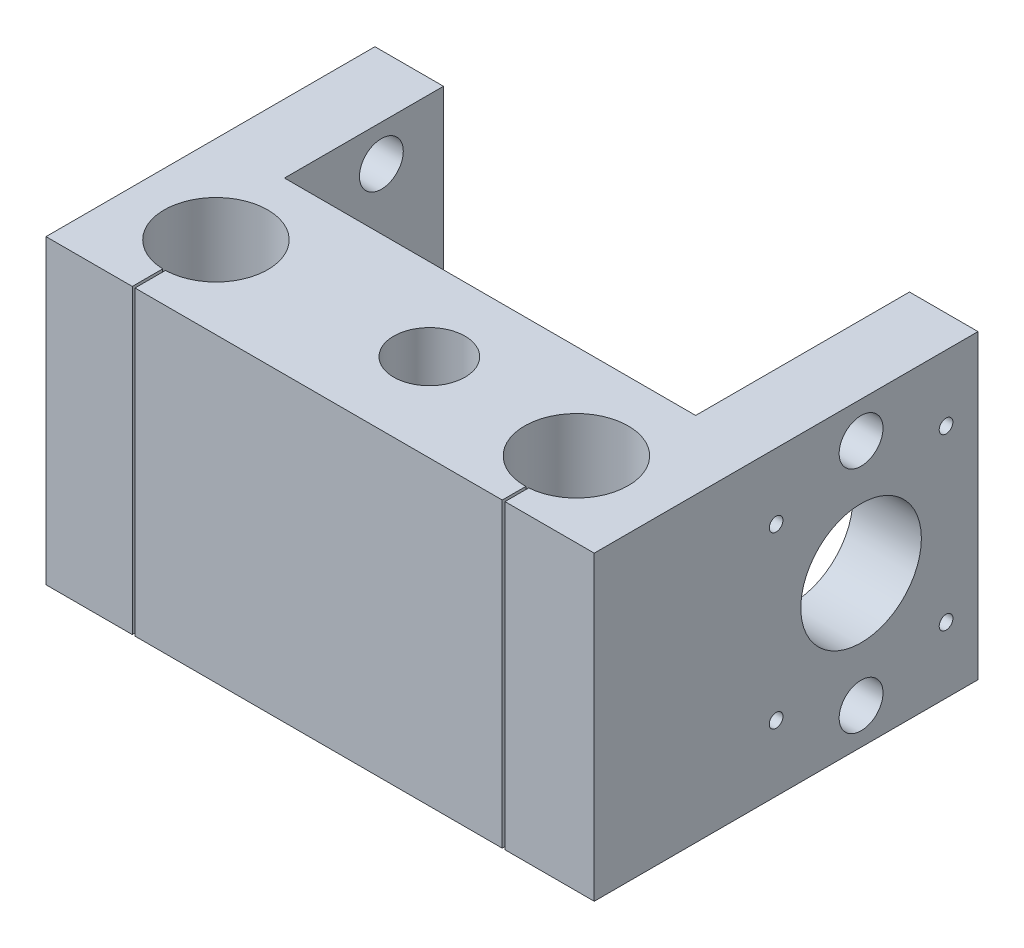
ISO-10303-21;
HEADER;
FILE_DESCRIPTION(('STEP AP214'),'2;1');
FILE_NAME('part.step','',(''),(''),'','','');
FILE_SCHEMA(('AUTOMOTIVE_DESIGN { 1 0 10303 214 1 1 1 1 }'));
ENDSEC;
DATA;
#1=APPLICATION_CONTEXT('core data for automotive mechanical design processes');
#2=APPLICATION_PROTOCOL_DEFINITION('international standard','automotive_design',2000,#1);
#3=PRODUCT_CONTEXT('',#1,'mechanical');
#4=PRODUCT('Part','Part','',(#3));
#5=PRODUCT_RELATED_PRODUCT_CATEGORY('part','',(#4));
#6=PRODUCT_DEFINITION_FORMATION('','',#4);
#7=PRODUCT_DEFINITION_CONTEXT('part definition',#1,'design');
#8=PRODUCT_DEFINITION('design','',#6,#7);
#9=PRODUCT_DEFINITION_SHAPE('','',#8);
#10=(LENGTH_UNIT() NAMED_UNIT(*) SI_UNIT(.MILLI.,.METRE.));
#11=(NAMED_UNIT(*) PLANE_ANGLE_UNIT() SI_UNIT($,.RADIAN.));
#12=(NAMED_UNIT(*) SI_UNIT($,.STERADIAN.) SOLID_ANGLE_UNIT());
#13=UNCERTAINTY_MEASURE_WITH_UNIT(LENGTH_MEASURE(1.E-05),#10,'distance_accuracy_value','');
#14=(GEOMETRIC_REPRESENTATION_CONTEXT(3) GLOBAL_UNCERTAINTY_ASSIGNED_CONTEXT((#13)) GLOBAL_UNIT_ASSIGNED_CONTEXT((#10,
#11,#12)) REPRESENTATION_CONTEXT('',''));
#15=CARTESIAN_POINT('',(0.,0.,0.));
#16=DIRECTION('',(0.,0.,1.));
#17=DIRECTION('',(1.,0.,0.));
#18=AXIS2_PLACEMENT_3D('',#15,#16,#17);
#19=CARTESIAN_POINT('',(0.,55.,35.));
#20=DIRECTION('',(0.,0.,-1.));
#21=DIRECTION('',(-1.,0.,0.));
#22=AXIS2_PLACEMENT_3D('',#19,#20,#21);
#23=PLANE('',#22);
#24=DIRECTION('',(0.,-1.,0.));
#25=VECTOR('',#24,1.);
#26=CARTESIAN_POINT('',(-34.2640564316728,55.,35.));
#27=LINE('',#26,#25);
#28=CARTESIAN_POINT('',(-34.2640564316728,55.,35.));
#29=VERTEX_POINT('',#28);
#30=CARTESIAN_POINT('',(-34.2640564316728,0.,35.));
#31=VERTEX_POINT('',#30);
#32=EDGE_CURVE('E153',#29,#31,#27,.T.);
#33=ORIENTED_EDGE('',*,*,#32,.F.);
#34=DIRECTION('',(1.,0.,0.));
#35=VECTOR('',#34,1.);
#36=CARTESIAN_POINT('',(0.,55.,35.));
#37=LINE('',#36,#35);
#38=CARTESIAN_POINT('',(-50.,55.,35.));
#39=VERTEX_POINT('',#38);
#40=EDGE_CURVE('E228',#39,#29,#37,.T.);
#41=ORIENTED_EDGE('',*,*,#40,.F.);
#42=DIRECTION('',(0.,-1.,0.));
#43=VECTOR('',#42,1.);
#44=CARTESIAN_POINT('',(-50.,55.,35.));
#45=LINE('',#44,#43);
#46=CARTESIAN_POINT('',(-50.,0.,35.));
#47=VERTEX_POINT('',#46);
#48=EDGE_CURVE('E183',#39,#47,#45,.T.);
#49=ORIENTED_EDGE('',*,*,#48,.T.);
#50=DIRECTION('',(1.,0.,0.));
#51=VECTOR('',#50,1.);
#52=CARTESIAN_POINT('',(0.,0.,35.));
#53=LINE('',#52,#51);
#54=EDGE_CURVE('E173',#47,#31,#53,.T.);
#55=ORIENTED_EDGE('',*,*,#54,.T.);
#56=EDGE_LOOP('',(#33,#41,#49,#55));
#57=FACE_BOUND('',#56,.T.);
#58=ADVANCED_FACE('F41',(#57),#23,.F.);
#59=CARTESIAN_POINT('',(-33.7640564316728,55.,35.));
#60=VERTEX_POINT('',#59);
#61=CARTESIAN_POINT('',(33.2214587828726,55.,35.));
#62=VERTEX_POINT('',#61);
#63=EDGE_CURVE('E231',#60,#62,#37,.T.);
#64=ORIENTED_EDGE('',*,*,#63,.F.);
#65=DIRECTION('',(0.,-1.,0.));
#66=VECTOR('',#65,1.);
#67=CARTESIAN_POINT('',(-33.7640564316728,55.,35.));
#68=LINE('',#67,#66);
#69=CARTESIAN_POINT('',(-33.7640564316728,0.,35.));
#70=VERTEX_POINT('',#69);
#71=EDGE_CURVE('E165',#60,#70,#68,.T.);
#72=ORIENTED_EDGE('',*,*,#71,.T.);
#73=CARTESIAN_POINT('',(33.2214587828726,0.,35.));
#74=VERTEX_POINT('',#73);
#75=EDGE_CURVE('E186',#70,#74,#53,.T.);
#76=ORIENTED_EDGE('',*,*,#75,.T.);
#77=DIRECTION('',(0.,-1.,0.));
#78=VECTOR('',#77,1.);
#79=CARTESIAN_POINT('',(33.2214587828726,55.,35.));
#80=LINE('',#79,#78);
#81=EDGE_CURVE('E348',#62,#74,#80,.T.);
#82=ORIENTED_EDGE('',*,*,#81,.F.);
#83=EDGE_LOOP('',(#64,#72,#76,#82));
#84=FACE_BOUND('',#83,.T.);
#85=ADVANCED_FACE('F401',(#84),#23,.F.);
#86=CARTESIAN_POINT('',(0.,55.,-35.));
#87=DIRECTION('',(0.,0.,-1.));
#88=DIRECTION('',(-1.,0.,0.));
#89=AXIS2_PLACEMENT_3D('',#86,#87,#88);
#90=PLANE('',#89);
#91=DIRECTION('',(1.,0.,0.));
#92=VECTOR('',#91,1.);
#93=CARTESIAN_POINT('',(0.,0.,-35.));
#94=LINE('',#93,#92);
#95=CARTESIAN_POINT('',(37.5,0.,-35.));
#96=VERTEX_POINT('',#95);
#97=CARTESIAN_POINT('',(50.,0.,-35.));
#98=VERTEX_POINT('',#97);
#99=EDGE_CURVE('E218',#96,#98,#94,.T.);
#100=ORIENTED_EDGE('',*,*,#99,.F.);
#101=DIRECTION('',(0.,-1.,0.));
#102=VECTOR('',#101,1.);
#103=CARTESIAN_POINT('',(37.5,55.,-35.));
#104=LINE('',#103,#102);
#105=CARTESIAN_POINT('',(37.5,55.,-35.));
#106=VERTEX_POINT('',#105);
#107=EDGE_CURVE('E419',#106,#96,#104,.T.);
#108=ORIENTED_EDGE('',*,*,#107,.F.);
#109=DIRECTION('',(1.,0.,0.));
#110=VECTOR('',#109,1.);
#111=CARTESIAN_POINT('',(0.,55.,-35.));
#112=LINE('',#111,#110);
#113=CARTESIAN_POINT('',(50.,55.,-35.));
#114=VERTEX_POINT('',#113);
#115=EDGE_CURVE('E192',#106,#114,#112,.T.);
#116=ORIENTED_EDGE('',*,*,#115,.T.);
#117=DIRECTION('',(0.,-1.,0.));
#118=VECTOR('',#117,1.);
#119=CARTESIAN_POINT('',(50.,55.,-35.));
#120=LINE('',#119,#118);
#121=EDGE_CURVE('E227',#114,#98,#120,.T.);
#122=ORIENTED_EDGE('',*,*,#121,.T.);
#123=EDGE_LOOP('',(#100,#108,#116,#122));
#124=FACE_BOUND('',#123,.T.);
#125=ADVANCED_FACE('F418',(#124),#90,.T.);
#126=CARTESIAN_POINT('',(37.5,55.,0.));
#127=DIRECTION('',(1.,0.,0.));
#128=DIRECTION('',(0.,0.,-1.));
#129=AXIS2_PLACEMENT_3D('',#126,#127,#128);
#130=PLANE('',#129);
#131=CARTESIAN_POINT('',(37.5,48.4000000000001,-13.6731293068473));
#132=DIRECTION('',(1.,0.,0.));
#133=DIRECTION('',(0.,0.,-1.));
#134=AXIS2_PLACEMENT_3D('',#131,#132,#133);
#135=CIRCLE('',#134,4.);
#136=CARTESIAN_POINT('',(37.5,48.4000000000001,-17.6731293068473));
#137=VERTEX_POINT('',#136);
#138=EDGE_CURVE('E314',#137,#137,#135,.T.);
#139=ORIENTED_EDGE('',*,*,#138,.T.);
#140=EDGE_LOOP('',(#139));
#141=FACE_BOUND('',#140,.T.);
#142=CARTESIAN_POINT('',(37.5,6.60000000000007,-13.6731293068473));
#143=DIRECTION('',(1.,0.,0.));
#144=DIRECTION('',(0.,0.,-1.));
#145=AXIS2_PLACEMENT_3D('',#142,#143,#144);
#146=CIRCLE('',#145,4.);
#147=CARTESIAN_POINT('',(37.5,6.60000000000007,-17.6731293068473));
#148=VERTEX_POINT('',#147);
#149=EDGE_CURVE('E323',#148,#148,#146,.T.);
#150=ORIENTED_EDGE('',*,*,#149,.T.);
#151=EDGE_LOOP('',(#150));
#152=FACE_BOUND('',#151,.T.);
#153=CARTESIAN_POINT('',(37.5,27.5000000000001,-13.6731293068474));
#154=DIRECTION('',(1.,0.,0.));
#155=DIRECTION('',(0.,0.,-1.));
#156=AXIS2_PLACEMENT_3D('',#153,#154,#155);
#157=CIRCLE('',#156,11.);
#158=CARTESIAN_POINT('',(37.5,27.5000000000001,-24.6731293068474));
#159=VERTEX_POINT('',#158);
#160=EDGE_CURVE('E300',#159,#159,#157,.T.);
#161=ORIENTED_EDGE('',*,*,#160,.T.);
#162=EDGE_LOOP('',(#161));
#163=FACE_BOUND('',#162,.T.);
#164=CARTESIAN_POINT('',(37.5,43.,-29.1731293068474));
#165=DIRECTION('',(1.,0.,0.));
#166=DIRECTION('',(0.,0.,-1.));
#167=AXIS2_PLACEMENT_3D('',#164,#165,#166);
#168=CIRCLE('',#167,1.25);
#169=CARTESIAN_POINT('',(37.5,43.,-30.4231293068474));
#170=VERTEX_POINT('',#169);
#171=EDGE_CURVE('E272',#170,#170,#168,.T.);
#172=ORIENTED_EDGE('',*,*,#171,.T.);
#173=EDGE_LOOP('',(#172));
#174=FACE_BOUND('',#173,.T.);
#175=CARTESIAN_POINT('',(37.5,43.,1.82687069315264));
#176=DIRECTION('',(1.,0.,0.));
#177=DIRECTION('',(0.,0.,-1.));
#178=AXIS2_PLACEMENT_3D('',#175,#176,#177);
#179=CIRCLE('',#178,1.25);
#180=CARTESIAN_POINT('',(37.5,43.,0.576870693152641));
#181=VERTEX_POINT('',#180);
#182=EDGE_CURVE('E278',#181,#181,#179,.T.);
#183=ORIENTED_EDGE('',*,*,#182,.T.);
#184=EDGE_LOOP('',(#183));
#185=FACE_BOUND('',#184,.T.);
#186=CARTESIAN_POINT('',(37.5,12.,1.82687069315263));
#187=DIRECTION('',(1.,0.,0.));
#188=DIRECTION('',(0.,0.,-1.));
#189=AXIS2_PLACEMENT_3D('',#186,#187,#188);
#190=CIRCLE('',#189,1.25000000000001);
#191=CARTESIAN_POINT('',(37.5,12.,0.576870693152622));
#192=VERTEX_POINT('',#191);
#193=EDGE_CURVE('E282',#192,#192,#190,.T.);
#194=ORIENTED_EDGE('',*,*,#193,.T.);
#195=EDGE_LOOP('',(#194));
#196=FACE_BOUND('',#195,.T.);
#197=CARTESIAN_POINT('',(37.5,12.0000000000001,-29.1731293068474));
#198=DIRECTION('',(1.,0.,0.));
#199=DIRECTION('',(0.,0.,-1.));
#200=AXIS2_PLACEMENT_3D('',#197,#198,#199);
#201=CIRCLE('',#200,1.25);
#202=CARTESIAN_POINT('',(37.5,12.0000000000001,-30.4231293068474));
#203=VERTEX_POINT('',#202);
#204=EDGE_CURVE('E286',#203,#203,#201,.T.);
#205=ORIENTED_EDGE('',*,*,#204,.T.);
#206=EDGE_LOOP('',(#205));
#207=FACE_BOUND('',#206,.T.);
#208=DIRECTION('',(0.,0.,1.));
#209=VECTOR('',#208,1.);
#210=CARTESIAN_POINT('',(37.5,0.,0.));
#211=LINE('',#210,#209);
#212=CARTESIAN_POINT('',(37.5,0.,4.));
#213=VERTEX_POINT('',#212);
#214=EDGE_CURVE('E214',#96,#213,#211,.T.);
#215=ORIENTED_EDGE('',*,*,#214,.T.);
#216=DIRECTION('',(0.,-1.,0.));
#217=VECTOR('',#216,1.);
#218=CARTESIAN_POINT('',(37.5,55.,4.));
#219=LINE('',#218,#217);
#220=CARTESIAN_POINT('',(37.5,55.,4.));
#221=VERTEX_POINT('',#220);
#222=EDGE_CURVE('E425',#221,#213,#219,.T.);
#223=ORIENTED_EDGE('',*,*,#222,.F.);
#224=DIRECTION('',(0.,0.,1.));
#225=VECTOR('',#224,1.);
#226=CARTESIAN_POINT('',(37.5,55.,0.));
#227=LINE('',#226,#225);
#228=EDGE_CURVE('E243',#106,#221,#227,.T.);
#229=ORIENTED_EDGE('',*,*,#228,.F.);
#230=ORIENTED_EDGE('',*,*,#107,.T.);
#231=EDGE_LOOP('',(#215,#223,#229,#230));
#232=FACE_BOUND('',#231,.T.);
#233=ADVANCED_FACE('F43',(#141,#152,#163,#174,#185,#196,#207,#232),#130,.F.);
#234=CARTESIAN_POINT('',(0.,55.,4.));
#235=DIRECTION('',(0.,0.,-1.));
#236=DIRECTION('',(-1.,0.,0.));
#237=AXIS2_PLACEMENT_3D('',#234,#235,#236);
#238=PLANE('',#237);
#239=DIRECTION('',(1.,0.,0.));
#240=VECTOR('',#239,1.);
#241=CARTESIAN_POINT('',(0.,0.,4.));
#242=LINE('',#241,#240);
#243=CARTESIAN_POINT('',(-37.5,0.,4.));
#244=VERTEX_POINT('',#243);
#245=EDGE_CURVE('E208',#244,#213,#242,.T.);
#246=ORIENTED_EDGE('',*,*,#245,.F.);
#247=DIRECTION('',(0.,-1.,0.));
#248=VECTOR('',#247,1.);
#249=CARTESIAN_POINT('',(-37.5,55.,4.));
#250=LINE('',#249,#248);
#251=CARTESIAN_POINT('',(-37.5,55.,4.));
#252=VERTEX_POINT('',#251);
#253=EDGE_CURVE('E430',#252,#244,#250,.T.);
#254=ORIENTED_EDGE('',*,*,#253,.F.);
#255=DIRECTION('',(1.,0.,0.));
#256=VECTOR('',#255,1.);
#257=CARTESIAN_POINT('',(0.,55.,4.));
#258=LINE('',#257,#256);
#259=EDGE_CURVE('E239',#252,#221,#258,.T.);
#260=ORIENTED_EDGE('',*,*,#259,.T.);
#261=ORIENTED_EDGE('',*,*,#222,.T.);
#262=EDGE_LOOP('',(#246,#254,#260,#261));
#263=FACE_BOUND('',#262,.T.);
#264=ADVANCED_FACE('F433',(#263),#238,.T.);
#265=CARTESIAN_POINT('',(-37.5,55.,0.));
#266=DIRECTION('',(1.,0.,0.));
#267=DIRECTION('',(0.,0.,-1.));
#268=AXIS2_PLACEMENT_3D('',#265,#266,#267);
#269=PLANE('',#268);
#270=CARTESIAN_POINT('',(-37.5,27.5000000000001,-13.6731293068473));
#271=DIRECTION('',(1.,0.,0.));
#272=DIRECTION('',(0.,0.,-1.));
#273=AXIS2_PLACEMENT_3D('',#270,#271,#272);
#274=CIRCLE('',#273,4.);
#275=CARTESIAN_POINT('',(-37.5,27.5000000000001,-17.6731293068473));
#276=VERTEX_POINT('',#275);
#277=EDGE_CURVE('E341',#276,#276,#274,.T.);
#278=ORIENTED_EDGE('',*,*,#277,.F.);
#279=EDGE_LOOP('',(#278));
#280=FACE_BOUND('',#279,.T.);
#281=CARTESIAN_POINT('',(-37.5,48.4000000000001,-13.6731293068473));
#282=DIRECTION('',(1.,0.,0.));
#283=DIRECTION('',(0.,0.,-1.));
#284=AXIS2_PLACEMENT_3D('',#281,#282,#283);
#285=CIRCLE('',#284,4.);
#286=CARTESIAN_POINT('',(-37.5,48.4000000000001,-17.6731293068473));
#287=VERTEX_POINT('',#286);
#288=EDGE_CURVE('E318',#287,#287,#285,.T.);
#289=ORIENTED_EDGE('',*,*,#288,.F.);
#290=EDGE_LOOP('',(#289));
#291=FACE_BOUND('',#290,.T.);
#292=CARTESIAN_POINT('',(-37.5,6.60000000000007,-13.6731293068473));
#293=DIRECTION('',(1.,0.,0.));
#294=DIRECTION('',(0.,0.,-1.));
#295=AXIS2_PLACEMENT_3D('',#292,#293,#294);
#296=CIRCLE('',#295,4.);
#297=CARTESIAN_POINT('',(-37.5,6.60000000000007,-17.6731293068473));
#298=VERTEX_POINT('',#297);
#299=EDGE_CURVE('E327',#298,#298,#296,.T.);
#300=ORIENTED_EDGE('',*,*,#299,.F.);
#301=EDGE_LOOP('',(#300));
#302=FACE_BOUND('',#301,.T.);
#303=DIRECTION('',(0.,-1.,0.));
#304=VECTOR('',#303,1.);
#305=CARTESIAN_POINT('',(-37.5,0.,-25.));
#306=LINE('',#305,#304);
#307=CARTESIAN_POINT('',(-37.5,55.,-25.));
#308=VERTEX_POINT('',#307);
#309=CARTESIAN_POINT('',(-37.5,0.,-25.));
#310=VERTEX_POINT('',#309);
#311=EDGE_CURVE('E257',#308,#310,#306,.T.);
#312=ORIENTED_EDGE('',*,*,#311,.F.);
#313=DIRECTION('',(0.,0.,1.));
#314=VECTOR('',#313,1.);
#315=CARTESIAN_POINT('',(-37.5,55.,0.));
#316=LINE('',#315,#314);
#317=EDGE_CURVE('E236',#308,#252,#316,.T.);
#318=ORIENTED_EDGE('',*,*,#317,.T.);
#319=ORIENTED_EDGE('',*,*,#253,.T.);
#320=DIRECTION('',(0.,0.,1.));
#321=VECTOR('',#320,1.);
#322=CARTESIAN_POINT('',(-37.5,0.,0.));
#323=LINE('',#322,#321);
#324=EDGE_CURVE('E204',#310,#244,#323,.T.);
#325=ORIENTED_EDGE('',*,*,#324,.F.);
#326=EDGE_LOOP('',(#312,#318,#319,#325));
#327=FACE_BOUND('',#326,.T.);
#328=ADVANCED_FACE('F466',(#280,#291,#302,#327),#269,.T.);
#329=CARTESIAN_POINT('',(-50.,55.,0.));
#330=DIRECTION('',(1.,0.,0.));
#331=DIRECTION('',(0.,0.,-1.));
#332=AXIS2_PLACEMENT_3D('',#329,#330,#331);
#333=PLANE('',#332);
#334=CARTESIAN_POINT('',(-50.,27.5000000000001,-13.6731293068473));
#335=DIRECTION('',(1.,0.,0.));
#336=DIRECTION('',(0.,0.,-1.));
#337=AXIS2_PLACEMENT_3D('',#334,#335,#336);
#338=CIRCLE('',#337,4.);
#339=CARTESIAN_POINT('',(-50.,27.5000000000001,-17.6731293068473));
#340=VERTEX_POINT('',#339);
#341=EDGE_CURVE('E337',#340,#340,#338,.T.);
#342=ORIENTED_EDGE('',*,*,#341,.T.);
#343=EDGE_LOOP('',(#342));
#344=FACE_BOUND('',#343,.T.);
#345=CARTESIAN_POINT('',(-50.,48.4000000000001,-13.6731293068473));
#346=DIRECTION('',(1.,0.,0.));
#347=DIRECTION('',(0.,0.,-1.));
#348=AXIS2_PLACEMENT_3D('',#345,#346,#347);
#349=CIRCLE('',#348,4.);
#350=CARTESIAN_POINT('',(-50.,48.4000000000001,-17.6731293068473));
#351=VERTEX_POINT('',#350);
#352=EDGE_CURVE('E336',#351,#351,#349,.T.);
#353=ORIENTED_EDGE('',*,*,#352,.T.);
#354=EDGE_LOOP('',(#353));
#355=FACE_BOUND('',#354,.T.);
#356=CARTESIAN_POINT('',(-50.,6.60000000000007,-13.6731293068473));
#357=DIRECTION('',(1.,0.,0.));
#358=DIRECTION('',(0.,0.,-1.));
#359=AXIS2_PLACEMENT_3D('',#356,#357,#358);
#360=CIRCLE('',#359,4.);
#361=CARTESIAN_POINT('',(-50.,6.60000000000007,-17.6731293068473));
#362=VERTEX_POINT('',#361);
#363=EDGE_CURVE('E332',#362,#362,#360,.T.);
#364=ORIENTED_EDGE('',*,*,#363,.T.);
#365=EDGE_LOOP('',(#364));
#366=FACE_BOUND('',#365,.T.);
#367=DIRECTION('',(0.,0.,1.));
#368=VECTOR('',#367,1.);
#369=CARTESIAN_POINT('',(-50.,55.,0.));
#370=LINE('',#369,#368);
#371=CARTESIAN_POINT('',(-50.,55.,-25.));
#372=VERTEX_POINT('',#371);
#373=EDGE_CURVE('E233',#372,#39,#370,.T.);
#374=ORIENTED_EDGE('',*,*,#373,.F.);
#375=DIRECTION('',(0.,1.,0.));
#376=VECTOR('',#375,1.);
#377=CARTESIAN_POINT('',(-50.,0.,-25.));
#378=LINE('',#377,#376);
#379=CARTESIAN_POINT('',(-50.,0.,-25.));
#380=VERTEX_POINT('',#379);
#381=EDGE_CURVE('E251',#380,#372,#378,.T.);
#382=ORIENTED_EDGE('',*,*,#381,.F.);
#383=DIRECTION('',(0.,0.,1.));
#384=VECTOR('',#383,1.);
#385=CARTESIAN_POINT('',(-50.,0.,0.));
#386=LINE('',#385,#384);
#387=EDGE_CURVE('E197',#380,#47,#386,.T.);
#388=ORIENTED_EDGE('',*,*,#387,.T.);
#389=ORIENTED_EDGE('',*,*,#48,.F.);
#390=EDGE_LOOP('',(#374,#382,#388,#389));
#391=FACE_BOUND('',#390,.T.);
#392=ADVANCED_FACE('F470',(#344,#355,#366,#391),#333,.F.);
#393=CARTESIAN_POINT('',(33.7214587828726,55.,35.));
#394=VERTEX_POINT('',#393);
#395=CARTESIAN_POINT('',(50.,55.,35.));
#396=VERTEX_POINT('',#395);
#397=EDGE_CURVE('E232',#394,#396,#37,.T.);
#398=ORIENTED_EDGE('',*,*,#397,.F.);
#399=DIRECTION('',(0.,-1.,0.));
#400=VECTOR('',#399,1.);
#401=CARTESIAN_POINT('',(33.7214587828726,55.,35.));
#402=LINE('',#401,#400);
#403=CARTESIAN_POINT('',(33.7214587828726,0.,35.));
#404=VERTEX_POINT('',#403);
#405=EDGE_CURVE('E345',#394,#404,#402,.T.);
#406=ORIENTED_EDGE('',*,*,#405,.T.);
#407=CARTESIAN_POINT('',(50.,0.,35.));
#408=VERTEX_POINT('',#407);
#409=EDGE_CURVE('E188',#404,#408,#53,.T.);
#410=ORIENTED_EDGE('',*,*,#409,.T.);
#411=DIRECTION('',(0.,-1.,0.));
#412=VECTOR('',#411,1.);
#413=CARTESIAN_POINT('',(50.,55.,35.));
#414=LINE('',#413,#412);
#415=EDGE_CURVE('E408',#396,#408,#414,.T.);
#416=ORIENTED_EDGE('',*,*,#415,.F.);
#417=EDGE_LOOP('',(#398,#406,#410,#416));
#418=FACE_BOUND('',#417,.T.);
#419=ADVANCED_FACE('F409',(#418),#23,.F.);
#420=CARTESIAN_POINT('',(50.,55.,0.));
#421=DIRECTION('',(1.,0.,0.));
#422=DIRECTION('',(0.,0.,-1.));
#423=AXIS2_PLACEMENT_3D('',#420,#421,#422);
#424=PLANE('',#423);
#425=CARTESIAN_POINT('',(50.,48.4000000000001,-13.6731293068473));
#426=DIRECTION('',(1.,0.,0.));
#427=DIRECTION('',(0.,0.,-1.));
#428=AXIS2_PLACEMENT_3D('',#425,#426,#427);
#429=CIRCLE('',#428,4.);
#430=CARTESIAN_POINT('',(50.,48.4000000000001,-17.6731293068473));
#431=VERTEX_POINT('',#430);
#432=EDGE_CURVE('E322',#431,#431,#429,.T.);
#433=ORIENTED_EDGE('',*,*,#432,.F.);
#434=EDGE_LOOP('',(#433));
#435=FACE_BOUND('',#434,.T.);
#436=CARTESIAN_POINT('',(50.,6.60000000000007,-13.6731293068473));
#437=DIRECTION('',(1.,0.,0.));
#438=DIRECTION('',(0.,0.,-1.));
#439=AXIS2_PLACEMENT_3D('',#436,#437,#438);
#440=CIRCLE('',#439,4.);
#441=CARTESIAN_POINT('',(50.,6.60000000000007,-17.6731293068473));
#442=VERTEX_POINT('',#441);
#443=EDGE_CURVE('E331',#442,#442,#440,.T.);
#444=ORIENTED_EDGE('',*,*,#443,.F.);
#445=EDGE_LOOP('',(#444));
#446=FACE_BOUND('',#445,.T.);
#447=CARTESIAN_POINT('',(50.,27.5000000000001,-13.6731293068474));
#448=DIRECTION('',(1.,0.,0.));
#449=DIRECTION('',(0.,0.,-1.));
#450=AXIS2_PLACEMENT_3D('',#447,#448,#449);
#451=CIRCLE('',#450,11.);
#452=CARTESIAN_POINT('',(50.,27.5000000000001,-24.6731293068474));
#453=VERTEX_POINT('',#452);
#454=EDGE_CURVE('E310',#453,#453,#451,.T.);
#455=ORIENTED_EDGE('',*,*,#454,.F.);
#456=EDGE_LOOP('',(#455));
#457=FACE_BOUND('',#456,.T.);
#458=CARTESIAN_POINT('',(50.,43.,-29.1731293068474));
#459=DIRECTION('',(1.,0.,0.));
#460=DIRECTION('',(0.,0.,-1.));
#461=AXIS2_PLACEMENT_3D('',#458,#459,#460);
#462=CIRCLE('',#461,1.25);
#463=CARTESIAN_POINT('',(50.,43.,-30.4231293068474));
#464=VERTEX_POINT('',#463);
#465=EDGE_CURVE('E295',#464,#464,#462,.T.);
#466=ORIENTED_EDGE('',*,*,#465,.F.);
#467=EDGE_LOOP('',(#466));
#468=FACE_BOUND('',#467,.T.);
#469=CARTESIAN_POINT('',(50.,43.,1.82687069315264));
#470=DIRECTION('',(1.,0.,0.));
#471=DIRECTION('',(0.,0.,-1.));
#472=AXIS2_PLACEMENT_3D('',#469,#470,#471);
#473=CIRCLE('',#472,1.25);
#474=CARTESIAN_POINT('',(50.,43.,0.576870693152637));
#475=VERTEX_POINT('',#474);
#476=EDGE_CURVE('E299',#475,#475,#473,.T.);
#477=ORIENTED_EDGE('',*,*,#476,.F.);
#478=EDGE_LOOP('',(#477));
#479=FACE_BOUND('',#478,.T.);
#480=CARTESIAN_POINT('',(50.,12.,1.82687069315262));
#481=DIRECTION('',(1.,0.,0.));
#482=DIRECTION('',(0.,0.,-1.));
#483=AXIS2_PLACEMENT_3D('',#480,#481,#482);
#484=CIRCLE('',#483,1.25000000000001);
#485=CARTESIAN_POINT('',(50.,12.,0.576870693152618));
#486=VERTEX_POINT('',#485);
#487=EDGE_CURVE('E294',#486,#486,#484,.T.);
#488=ORIENTED_EDGE('',*,*,#487,.F.);
#489=EDGE_LOOP('',(#488));
#490=FACE_BOUND('',#489,.T.);
#491=CARTESIAN_POINT('',(50.,12.0000000000001,-29.1731293068474));
#492=DIRECTION('',(1.,0.,0.));
#493=DIRECTION('',(0.,0.,-1.));
#494=AXIS2_PLACEMENT_3D('',#491,#492,#493);
#495=CIRCLE('',#494,1.25);
#496=CARTESIAN_POINT('',(50.,12.0000000000001,-30.4231293068474));
#497=VERTEX_POINT('',#496);
#498=EDGE_CURVE('E290',#497,#497,#495,.T.);
#499=ORIENTED_EDGE('',*,*,#498,.F.);
#500=EDGE_LOOP('',(#499));
#501=FACE_BOUND('',#500,.T.);
#502=DIRECTION('',(0.,0.,1.));
#503=VECTOR('',#502,1.);
#504=CARTESIAN_POINT('',(50.,0.,0.));
#505=LINE('',#504,#503);
#506=EDGE_CURVE('E185',#98,#408,#505,.T.);
#507=ORIENTED_EDGE('',*,*,#506,.F.);
#508=ORIENTED_EDGE('',*,*,#121,.F.);
#509=DIRECTION('',(0.,0.,1.));
#510=VECTOR('',#509,1.);
#511=CARTESIAN_POINT('',(50.,55.,0.));
#512=LINE('',#511,#510);
#513=EDGE_CURVE('E223',#114,#396,#512,.T.);
#514=ORIENTED_EDGE('',*,*,#513,.T.);
#515=ORIENTED_EDGE('',*,*,#415,.T.);
#516=EDGE_LOOP('',(#507,#508,#514,#515));
#517=FACE_BOUND('',#516,.T.);
#518=ADVANCED_FACE('F391',(#435,#446,#457,#468,#479,#490,#501,#517),#424,.T.);
#519=CARTESIAN_POINT('',(0.,55.,0.));
#520=DIRECTION('',(0.,1.,0.));
#521=DIRECTION('',(0.,0.,1.));
#522=AXIS2_PLACEMENT_3D('',#519,#520,#521);
#523=PLANE('',#522);
#524=CARTESIAN_POINT('',(3.92538324830508,55.,19.));
#525=DIRECTION('',(0.,1.,0.));
#526=DIRECTION('',(0.,0.,1.));
#527=AXIS2_PLACEMENT_3D('',#524,#525,#526);
#528=CIRCLE('',#527,6.5);
#529=CARTESIAN_POINT('',(3.92538324830508,55.,25.5));
#530=VERTEX_POINT('',#529);
#531=EDGE_CURVE('E372',#530,#530,#528,.T.);
#532=ORIENTED_EDGE('',*,*,#531,.F.);
#533=EDGE_LOOP('',(#532));
#534=FACE_BOUND('',#533,.T.);
#535=DIRECTION('',(0.,0.,1.));
#536=VECTOR('',#535,1.);
#537=CARTESIAN_POINT('',(-33.7640564316728,55.,27.0280887580647));
#538=LINE('',#537,#536);
#539=CARTESIAN_POINT('',(-33.7640564316728,55.,29.4470540716439));
#540=VERTEX_POINT('',#539);
#541=EDGE_CURVE('E178',#540,#60,#538,.T.);
#542=ORIENTED_EDGE('',*,*,#541,.T.);
#543=ORIENTED_EDGE('',*,*,#63,.T.);
#544=DIRECTION('',(0.,0.,1.));
#545=VECTOR('',#544,1.);
#546=CARTESIAN_POINT('',(33.2214587828726,55.,28.5713865865584));
#547=LINE('',#546,#545);
#548=CARTESIAN_POINT('',(33.2214587828726,55.,30.6974047233877));
#549=VERTEX_POINT('',#548);
#550=EDGE_CURVE('E356',#549,#62,#547,.T.);
#551=ORIENTED_EDGE('',*,*,#550,.F.);
#552=CARTESIAN_POINT('',(33.,55.,21.25));
#553=DIRECTION('',(0.,1.,0.));
#554=DIRECTION('',(0.,0.,1.));
#555=AXIS2_PLACEMENT_3D('',#552,#553,#554);
#556=CIRCLE('',#555,9.45);
#557=CARTESIAN_POINT('',(33.7214587828726,55.,30.6724199240225));
#558=VERTEX_POINT('',#557);
#559=EDGE_CURVE('E261',#558,#549,#556,.T.);
#560=ORIENTED_EDGE('',*,*,#559,.F.);
#561=DIRECTION('',(0.,0.,1.));
#562=VECTOR('',#561,1.);
#563=CARTESIAN_POINT('',(33.7214587828726,55.,28.5713865865584));
#564=LINE('',#563,#562);
#565=EDGE_CURVE('E57',#558,#394,#564,.T.);
#566=ORIENTED_EDGE('',*,*,#565,.T.);
#567=ORIENTED_EDGE('',*,*,#397,.T.);
#568=ORIENTED_EDGE('',*,*,#513,.F.);
#569=ORIENTED_EDGE('',*,*,#115,.F.);
#570=ORIENTED_EDGE('',*,*,#228,.T.);
#571=ORIENTED_EDGE('',*,*,#259,.F.);
#572=ORIENTED_EDGE('',*,*,#317,.F.);
#573=DIRECTION('',(1.,0.,0.));
#574=VECTOR('',#573,1.);
#575=CARTESIAN_POINT('',(-37.5,55.,-25.));
#576=LINE('',#575,#574);
#577=EDGE_CURVE('E222',#372,#308,#576,.T.);
#578=ORIENTED_EDGE('',*,*,#577,.F.);
#579=ORIENTED_EDGE('',*,*,#373,.T.);
#580=ORIENTED_EDGE('',*,*,#40,.T.);
#581=DIRECTION('',(0.,0.,1.));
#582=VECTOR('',#581,1.);
#583=CARTESIAN_POINT('',(-34.2640564316728,55.,27.0280887580647));
#584=LINE('',#583,#582);
#585=CARTESIAN_POINT('',(-34.2640564316728,55.,29.4463100838841));
#586=VERTEX_POINT('',#585);
#587=EDGE_CURVE('E159',#586,#29,#584,.T.);
#588=ORIENTED_EDGE('',*,*,#587,.F.);
#589=CARTESIAN_POINT('',(-34.0000000000004,55.,19.9999999999999));
#590=DIRECTION('',(0.,1.,0.));
#591=DIRECTION('',(0.,0.,1.));
#592=AXIS2_PLACEMENT_3D('',#589,#590,#591);
#593=CIRCLE('',#592,9.45);
#594=EDGE_CURVE('E268',#540,#586,#593,.T.);
#595=ORIENTED_EDGE('',*,*,#594,.F.);
#596=EDGE_LOOP('',(#542,#543,#551,#560,#566,#567,#568,#569,#570,#571,#572,#578,#579,#580,#588,#595));
#597=FACE_BOUND('',#596,.T.);
#598=ADVANCED_FACE('F388',(#534,#597),#523,.T.);
#599=CARTESIAN_POINT('',(0.,0.,0.));
#600=DIRECTION('',(0.,1.,0.));
#601=DIRECTION('',(0.,0.,1.));
#602=AXIS2_PLACEMENT_3D('',#599,#600,#601);
#603=PLANE('',#602);
#604=CARTESIAN_POINT('',(3.92538324830508,0.,19.));
#605=DIRECTION('',(0.,1.,0.));
#606=DIRECTION('',(0.,0.,1.));
#607=AXIS2_PLACEMENT_3D('',#604,#605,#606);
#608=CIRCLE('',#607,6.5);
#609=CARTESIAN_POINT('',(3.92538324830508,0.,25.5));
#610=VERTEX_POINT('',#609);
#611=EDGE_CURVE('E359',#610,#610,#608,.T.);
#612=ORIENTED_EDGE('',*,*,#611,.T.);
#613=EDGE_LOOP('',(#612));
#614=FACE_BOUND('',#613,.T.);
#615=ORIENTED_EDGE('',*,*,#75,.F.);
#616=DIRECTION('',(0.,0.,1.));
#617=VECTOR('',#616,1.);
#618=CARTESIAN_POINT('',(-33.7640564316728,0.,27.0280887580647));
#619=LINE('',#618,#617);
#620=CARTESIAN_POINT('',(-33.7640564316728,0.,29.4470540716439));
#621=VERTEX_POINT('',#620);
#622=EDGE_CURVE('E179',#621,#70,#619,.T.);
#623=ORIENTED_EDGE('',*,*,#622,.F.);
#624=CARTESIAN_POINT('',(-34.0000000000004,0.,19.9999999999999));
#625=DIRECTION('',(0.,1.,0.));
#626=DIRECTION('',(0.,0.,1.));
#627=AXIS2_PLACEMENT_3D('',#624,#625,#626);
#628=CIRCLE('',#627,9.45);
#629=CARTESIAN_POINT('',(-34.2640564316728,0.,29.4463100838841));
#630=VERTEX_POINT('',#629);
#631=EDGE_CURVE('E176',#621,#630,#628,.T.);
#632=ORIENTED_EDGE('',*,*,#631,.T.);
#633=DIRECTION('',(0.,0.,1.));
#634=VECTOR('',#633,1.);
#635=CARTESIAN_POINT('',(-34.2640564316728,0.,27.0280887580647));
#636=LINE('',#635,#634);
#637=EDGE_CURVE('E156',#630,#31,#636,.T.);
#638=ORIENTED_EDGE('',*,*,#637,.T.);
#639=ORIENTED_EDGE('',*,*,#54,.F.);
#640=ORIENTED_EDGE('',*,*,#387,.F.);
#641=DIRECTION('',(-1.,0.,0.));
#642=VECTOR('',#641,1.);
#643=CARTESIAN_POINT('',(-37.5,0.,-25.));
#644=LINE('',#643,#642);
#645=EDGE_CURVE('E254',#310,#380,#644,.T.);
#646=ORIENTED_EDGE('',*,*,#645,.F.);
#647=ORIENTED_EDGE('',*,*,#324,.T.);
#648=ORIENTED_EDGE('',*,*,#245,.T.);
#649=ORIENTED_EDGE('',*,*,#214,.F.);
#650=ORIENTED_EDGE('',*,*,#99,.T.);
#651=ORIENTED_EDGE('',*,*,#506,.T.);
#652=ORIENTED_EDGE('',*,*,#409,.F.);
#653=DIRECTION('',(0.,0.,1.));
#654=VECTOR('',#653,1.);
#655=CARTESIAN_POINT('',(33.7214587828726,0.,28.5713865865584));
#656=LINE('',#655,#654);
#657=CARTESIAN_POINT('',(33.7214587828726,0.,30.6724199240225));
#658=VERTEX_POINT('',#657);
#659=EDGE_CURVE('E360',#658,#404,#656,.T.);
#660=ORIENTED_EDGE('',*,*,#659,.F.);
#661=CARTESIAN_POINT('',(33.,0.,21.25));
#662=DIRECTION('',(0.,1.,0.));
#663=DIRECTION('',(0.,0.,1.));
#664=AXIS2_PLACEMENT_3D('',#661,#662,#663);
#665=CIRCLE('',#664,9.45);
#666=CARTESIAN_POINT('',(33.2214587828726,0.,30.6974047233877));
#667=VERTEX_POINT('',#666);
#668=EDGE_CURVE('E260',#658,#667,#665,.T.);
#669=ORIENTED_EDGE('',*,*,#668,.T.);
#670=DIRECTION('',(0.,0.,1.));
#671=VECTOR('',#670,1.);
#672=CARTESIAN_POINT('',(33.2214587828726,0.,28.5713865865584));
#673=LINE('',#672,#671);
#674=EDGE_CURVE('E64',#667,#74,#673,.T.);
#675=ORIENTED_EDGE('',*,*,#674,.T.);
#676=EDGE_LOOP('',(#615,#623,#632,#638,#639,#640,#646,#647,#648,#649,#650,#651,#652,#660,#669,#675));
#677=FACE_BOUND('',#676,.T.);
#678=ADVANCED_FACE('F171',(#614,#677),#603,.F.);
#679=CARTESIAN_POINT('',(0.,0.,-25.));
#680=DIRECTION('',(0.,0.,1.));
#681=DIRECTION('',(1.,0.,0.));
#682=AXIS2_PLACEMENT_3D('',#679,#680,#681);
#683=PLANE('',#682);
#684=ORIENTED_EDGE('',*,*,#311,.T.);
#685=ORIENTED_EDGE('',*,*,#645,.T.);
#686=ORIENTED_EDGE('',*,*,#381,.T.);
#687=ORIENTED_EDGE('',*,*,#577,.T.);
#688=EDGE_LOOP('',(#684,#685,#686,#687));
#689=FACE_BOUND('',#688,.T.);
#690=ADVANCED_FACE('F546',(#689),#683,.F.);
#691=CARTESIAN_POINT('',(33.,0.,21.25));
#692=DIRECTION('',(0.,1.,0.));
#693=DIRECTION('',(0.,0.,1.));
#694=AXIS2_PLACEMENT_3D('',#691,#692,#693);
#695=CYLINDRICAL_SURFACE('',#694,9.45);
#696=ORIENTED_EDGE('',*,*,#668,.F.);
#697=DIRECTION('',(0.,1.,0.));
#698=VECTOR('',#697,1.);
#699=CARTESIAN_POINT('',(33.7214587828726,0.,30.6724199240225));
#700=LINE('',#699,#698);
#701=EDGE_CURVE('E11',#658,#558,#700,.T.);
#702=ORIENTED_EDGE('',*,*,#701,.T.);
#703=ORIENTED_EDGE('',*,*,#559,.T.);
#704=DIRECTION('',(0.,1.,0.));
#705=VECTOR('',#704,1.);
#706=CARTESIAN_POINT('',(33.2214587828726,0.,30.6974047233877));
#707=LINE('',#706,#705);
#708=EDGE_CURVE('E50',#667,#549,#707,.T.);
#709=ORIENTED_EDGE('',*,*,#708,.F.);
#710=EDGE_LOOP('',(#696,#702,#703,#709));
#711=FACE_BOUND('',#710,.T.);
#712=ADVANCED_FACE('F462',(#711),#695,.F.);
#713=CARTESIAN_POINT('',(-34.0000000000004,0.,19.9999999999999));
#714=DIRECTION('',(0.,1.,0.));
#715=DIRECTION('',(0.,0.,1.));
#716=AXIS2_PLACEMENT_3D('',#713,#714,#715);
#717=CYLINDRICAL_SURFACE('',#716,9.45);
#718=ORIENTED_EDGE('',*,*,#631,.F.);
#719=DIRECTION('',(0.,1.,0.));
#720=VECTOR('',#719,1.);
#721=CARTESIAN_POINT('',(-33.7640564316728,0.,29.4470540716439));
#722=LINE('',#721,#720);
#723=EDGE_CURVE('E456',#621,#540,#722,.T.);
#724=ORIENTED_EDGE('',*,*,#723,.T.);
#725=ORIENTED_EDGE('',*,*,#594,.T.);
#726=DIRECTION('',(0.,1.,0.));
#727=VECTOR('',#726,1.);
#728=CARTESIAN_POINT('',(-34.2640564316728,0.,29.4463100838841));
#729=LINE('',#728,#727);
#730=EDGE_CURVE('E444',#630,#586,#729,.T.);
#731=ORIENTED_EDGE('',*,*,#730,.F.);
#732=EDGE_LOOP('',(#718,#724,#725,#731));
#733=FACE_BOUND('',#732,.T.);
#734=ADVANCED_FACE('F472',(#733),#717,.F.);
#735=CARTESIAN_POINT('',(15.,12.0000000000001,-29.1731293068474));
#736=DIRECTION('',(1.,0.,0.));
#737=DIRECTION('',(0.,0.,-1.));
#738=AXIS2_PLACEMENT_3D('',#735,#736,#737);
#739=CYLINDRICAL_SURFACE('',#738,1.25);
#740=ORIENTED_EDGE('',*,*,#498,.T.);
#741=EDGE_LOOP('',(#740));
#742=FACE_BOUND('',#741,.T.);
#743=ORIENTED_EDGE('',*,*,#204,.F.);
#744=EDGE_LOOP('',(#743));
#745=FACE_BOUND('',#744,.T.);
#746=ADVANCED_FACE('F527',(#742,#745),#739,.F.);
#747=CARTESIAN_POINT('',(15.,12.,1.82687069315263));
#748=DIRECTION('',(1.,0.,0.));
#749=DIRECTION('',(0.,0.,-1.));
#750=AXIS2_PLACEMENT_3D('',#747,#748,#749);
#751=CYLINDRICAL_SURFACE('',#750,1.25000000000001);
#752=ORIENTED_EDGE('',*,*,#487,.T.);
#753=EDGE_LOOP('',(#752));
#754=FACE_BOUND('',#753,.T.);
#755=ORIENTED_EDGE('',*,*,#193,.F.);
#756=EDGE_LOOP('',(#755));
#757=FACE_BOUND('',#756,.T.);
#758=ADVANCED_FACE('F529',(#754,#757),#751,.F.);
#759=CARTESIAN_POINT('',(15.,43.,1.82687069315265));
#760=DIRECTION('',(1.,0.,0.));
#761=DIRECTION('',(0.,0.,-1.));
#762=AXIS2_PLACEMENT_3D('',#759,#760,#761);
#763=CYLINDRICAL_SURFACE('',#762,1.25);
#764=ORIENTED_EDGE('',*,*,#476,.T.);
#765=EDGE_LOOP('',(#764));
#766=FACE_BOUND('',#765,.T.);
#767=ORIENTED_EDGE('',*,*,#182,.F.);
#768=EDGE_LOOP('',(#767));
#769=FACE_BOUND('',#768,.T.);
#770=ADVANCED_FACE('F536',(#766,#769),#763,.F.);
#771=CARTESIAN_POINT('',(15.,43.,-29.1731293068474));
#772=DIRECTION('',(1.,0.,0.));
#773=DIRECTION('',(0.,0.,-1.));
#774=AXIS2_PLACEMENT_3D('',#771,#772,#773);
#775=CYLINDRICAL_SURFACE('',#774,1.25);
#776=ORIENTED_EDGE('',*,*,#465,.T.);
#777=EDGE_LOOP('',(#776));
#778=FACE_BOUND('',#777,.T.);
#779=ORIENTED_EDGE('',*,*,#171,.F.);
#780=EDGE_LOOP('',(#779));
#781=FACE_BOUND('',#780,.T.);
#782=ADVANCED_FACE('F541',(#778,#781),#775,.F.);
#783=CARTESIAN_POINT('',(15.,27.5000000000001,-13.6731293068474));
#784=DIRECTION('',(1.,0.,0.));
#785=DIRECTION('',(0.,0.,-1.));
#786=AXIS2_PLACEMENT_3D('',#783,#784,#785);
#787=CYLINDRICAL_SURFACE('',#786,11.);
#788=ORIENTED_EDGE('',*,*,#454,.T.);
#789=EDGE_LOOP('',(#788));
#790=FACE_BOUND('',#789,.T.);
#791=ORIENTED_EDGE('',*,*,#160,.F.);
#792=EDGE_LOOP('',(#791));
#793=FACE_BOUND('',#792,.T.);
#794=ADVANCED_FACE('F686',(#790,#793),#787,.F.);
#795=CARTESIAN_POINT('',(-50.,6.60000000000007,-13.6731293068473));
#796=DIRECTION('',(1.,0.,0.));
#797=DIRECTION('',(0.,0.,-1.));
#798=AXIS2_PLACEMENT_3D('',#795,#796,#797);
#799=CYLINDRICAL_SURFACE('',#798,4.);
#800=ORIENTED_EDGE('',*,*,#443,.T.);
#801=EDGE_LOOP('',(#800));
#802=FACE_BOUND('',#801,.T.);
#803=ORIENTED_EDGE('',*,*,#149,.F.);
#804=EDGE_LOOP('',(#803));
#805=FACE_BOUND('',#804,.T.);
#806=ADVANCED_FACE('F675',(#802,#805),#799,.F.);
#807=CARTESIAN_POINT('',(-50.,48.4000000000001,-13.6731293068473));
#808=DIRECTION('',(1.,0.,0.));
#809=DIRECTION('',(0.,0.,-1.));
#810=AXIS2_PLACEMENT_3D('',#807,#808,#809);
#811=CYLINDRICAL_SURFACE('',#810,4.);
#812=ORIENTED_EDGE('',*,*,#432,.T.);
#813=EDGE_LOOP('',(#812));
#814=FACE_BOUND('',#813,.T.);
#815=ORIENTED_EDGE('',*,*,#138,.F.);
#816=EDGE_LOOP('',(#815));
#817=FACE_BOUND('',#816,.T.);
#818=ADVANCED_FACE('F668',(#814,#817),#811,.F.);
#819=ORIENTED_EDGE('',*,*,#299,.T.);
#820=EDGE_LOOP('',(#819));
#821=FACE_BOUND('',#820,.T.);
#822=ORIENTED_EDGE('',*,*,#363,.F.);
#823=EDGE_LOOP('',(#822));
#824=FACE_BOUND('',#823,.T.);
#825=ADVANCED_FACE('F665',(#821,#824),#799,.F.);
#826=ORIENTED_EDGE('',*,*,#288,.T.);
#827=EDGE_LOOP('',(#826));
#828=FACE_BOUND('',#827,.T.);
#829=ORIENTED_EDGE('',*,*,#352,.F.);
#830=EDGE_LOOP('',(#829));
#831=FACE_BOUND('',#830,.T.);
#832=ADVANCED_FACE('F655',(#828,#831),#811,.F.);
#833=CARTESIAN_POINT('',(-137.5,27.5000000000001,-13.6731293068473));
#834=DIRECTION('',(1.,0.,0.));
#835=DIRECTION('',(0.,0.,-1.));
#836=AXIS2_PLACEMENT_3D('',#833,#834,#835);
#837=CYLINDRICAL_SURFACE('',#836,4.);
#838=ORIENTED_EDGE('',*,*,#277,.T.);
#839=EDGE_LOOP('',(#838));
#840=FACE_BOUND('',#839,.T.);
#841=ORIENTED_EDGE('',*,*,#341,.F.);
#842=EDGE_LOOP('',(#841));
#843=FACE_BOUND('',#842,.T.);
#844=ADVANCED_FACE('F481',(#840,#843),#837,.F.);
#845=CARTESIAN_POINT('',(-34.2640564316728,55.,27.0280887580647));
#846=DIRECTION('',(1.,0.,0.));
#847=DIRECTION('',(0.,0.,-1.));
#848=AXIS2_PLACEMENT_3D('',#845,#846,#847);
#849=PLANE('',#848);
#850=ORIENTED_EDGE('',*,*,#32,.T.);
#851=ORIENTED_EDGE('',*,*,#637,.F.);
#852=ORIENTED_EDGE('',*,*,#730,.T.);
#853=ORIENTED_EDGE('',*,*,#587,.T.);
#854=EDGE_LOOP('',(#850,#851,#852,#853));
#855=FACE_BOUND('',#854,.T.);
#856=ADVANCED_FACE('F155',(#855),#849,.T.);
#857=CARTESIAN_POINT('',(-33.7640564316728,55.,27.0280887580647));
#858=DIRECTION('',(1.,0.,0.));
#859=DIRECTION('',(0.,0.,-1.));
#860=AXIS2_PLACEMENT_3D('',#857,#858,#859);
#861=PLANE('',#860);
#862=ORIENTED_EDGE('',*,*,#541,.F.);
#863=ORIENTED_EDGE('',*,*,#723,.F.);
#864=ORIENTED_EDGE('',*,*,#622,.T.);
#865=ORIENTED_EDGE('',*,*,#71,.F.);
#866=EDGE_LOOP('',(#862,#863,#864,#865));
#867=FACE_BOUND('',#866,.T.);
#868=ADVANCED_FACE('F473',(#867),#861,.F.);
#869=CARTESIAN_POINT('',(33.2214587828726,55.,28.5713865865584));
#870=DIRECTION('',(1.,0.,0.));
#871=DIRECTION('',(0.,0.,-1.));
#872=AXIS2_PLACEMENT_3D('',#869,#870,#871);
#873=PLANE('',#872);
#874=ORIENTED_EDGE('',*,*,#81,.T.);
#875=ORIENTED_EDGE('',*,*,#674,.F.);
#876=ORIENTED_EDGE('',*,*,#708,.T.);
#877=ORIENTED_EDGE('',*,*,#550,.T.);
#878=EDGE_LOOP('',(#874,#875,#876,#877));
#879=FACE_BOUND('',#878,.T.);
#880=ADVANCED_FACE('F459',(#879),#873,.T.);
#881=CARTESIAN_POINT('',(33.7214587828726,55.,28.5713865865584));
#882=DIRECTION('',(1.,0.,0.));
#883=DIRECTION('',(0.,0.,-1.));
#884=AXIS2_PLACEMENT_3D('',#881,#882,#883);
#885=PLANE('',#884);
#886=ORIENTED_EDGE('',*,*,#565,.F.);
#887=ORIENTED_EDGE('',*,*,#701,.F.);
#888=ORIENTED_EDGE('',*,*,#659,.T.);
#889=ORIENTED_EDGE('',*,*,#405,.F.);
#890=EDGE_LOOP('',(#886,#887,#888,#889));
#891=FACE_BOUND('',#890,.T.);
#892=ADVANCED_FACE('F384',(#891),#885,.F.);
#893=CARTESIAN_POINT('',(3.92538324830508,0.,19.));
#894=DIRECTION('',(0.,1.,0.));
#895=DIRECTION('',(0.,0.,1.));
#896=AXIS2_PLACEMENT_3D('',#893,#894,#895);
#897=CYLINDRICAL_SURFACE('',#896,6.5);
#898=ORIENTED_EDGE('',*,*,#611,.F.);
#899=EDGE_LOOP('',(#898));
#900=FACE_BOUND('',#899,.T.);
#901=ORIENTED_EDGE('',*,*,#531,.T.);
#902=EDGE_LOOP('',(#901));
#903=FACE_BOUND('',#902,.T.);
#904=ADVANCED_FACE('F381',(#900,#903),#897,.F.);
#905=CLOSED_SHELL('',(#58,#85,#125,#233,#264,#328,#392,#419,#518,#598,#678,#690,#712,#734,#746,
#758,#770,#782,#794,#806,#818,#825,#832,#844,#856,#868,#880,#892,#904));
#906=MANIFOLD_SOLID_BREP('B2',#905);
#907=ADVANCED_BREP_SHAPE_REPRESENTATION('',(#18,#906),#14);
#908=SHAPE_DEFINITION_REPRESENTATION(#9,#907);
ENDSEC;
END-ISO-10303-21;
